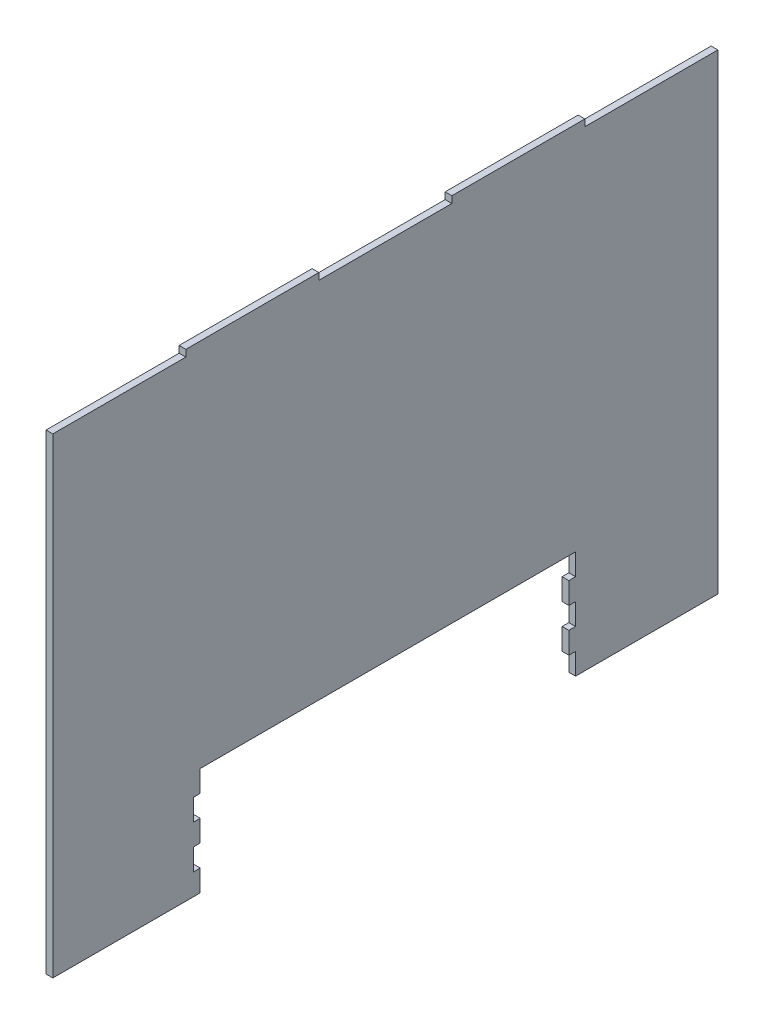
ISO-10303-21;
HEADER;
FILE_DESCRIPTION(('STEP AP214'),'2;1');
FILE_NAME('part.step','',(''),(''),'','','');
FILE_SCHEMA(('AUTOMOTIVE_DESIGN { 1 0 10303 214 1 1 1 1 }'));
ENDSEC;
DATA;
#1=APPLICATION_CONTEXT('core data for automotive mechanical design processes');
#2=APPLICATION_PROTOCOL_DEFINITION('international standard','automotive_design',2000,#1);
#3=PRODUCT_CONTEXT('',#1,'mechanical');
#4=PRODUCT('Part','Part','',(#3));
#5=PRODUCT_RELATED_PRODUCT_CATEGORY('part','',(#4));
#6=PRODUCT_DEFINITION_FORMATION('','',#4);
#7=PRODUCT_DEFINITION_CONTEXT('part definition',#1,'design');
#8=PRODUCT_DEFINITION('design','',#6,#7);
#9=PRODUCT_DEFINITION_SHAPE('','',#8);
#10=(LENGTH_UNIT() NAMED_UNIT(*) SI_UNIT(.MILLI.,.METRE.));
#11=(NAMED_UNIT(*) PLANE_ANGLE_UNIT() SI_UNIT($,.RADIAN.));
#12=(NAMED_UNIT(*) SI_UNIT($,.STERADIAN.) SOLID_ANGLE_UNIT());
#13=UNCERTAINTY_MEASURE_WITH_UNIT(LENGTH_MEASURE(1.E-05),#10,'distance_accuracy_value','');
#14=(GEOMETRIC_REPRESENTATION_CONTEXT(3) GLOBAL_UNCERTAINTY_ASSIGNED_CONTEXT((#13)) GLOBAL_UNIT_ASSIGNED_CONTEXT((#10,
#11,#12)) REPRESENTATION_CONTEXT('',''));
#15=CARTESIAN_POINT('',(0.,0.,0.));
#16=DIRECTION('',(0.,0.,1.));
#17=DIRECTION('',(1.,0.,0.));
#18=AXIS2_PLACEMENT_3D('',#15,#16,#17);
#19=CARTESIAN_POINT('',(5.,-72.5,-141.262721236259));
#20=DIRECTION('',(0.,1.,0.));
#21=DIRECTION('',(0.,0.,1.));
#22=AXIS2_PLACEMENT_3D('',#19,#20,#21);
#23=PLANE('',#22);
#24=DIRECTION('',(0.,0.,-1.));
#25=VECTOR('',#24,1.);
#26=CARTESIAN_POINT('',(0.,-72.5,-141.262721236259));
#27=LINE('',#26,#25);
#28=CARTESIAN_POINT('',(0.,-72.5,-141.262721236259));
#29=VERTEX_POINT('',#28);
#30=CARTESIAN_POINT('',(0.,-72.5,-247.));
#31=VERTEX_POINT('',#30);
#32=EDGE_CURVE('E273',#29,#31,#27,.T.);
#33=ORIENTED_EDGE('',*,*,#32,.T.);
#34=DIRECTION('',(-1.,0.,0.));
#35=VECTOR('',#34,1.);
#36=CARTESIAN_POINT('',(5.,-72.5,-247.));
#37=LINE('',#36,#35);
#38=CARTESIAN_POINT('',(5.,-72.5,-247.));
#39=VERTEX_POINT('',#38);
#40=EDGE_CURVE('E11',#39,#31,#37,.T.);
#41=ORIENTED_EDGE('',*,*,#40,.F.);
#42=DIRECTION('',(0.,0.,-1.));
#43=VECTOR('',#42,1.);
#44=CARTESIAN_POINT('',(5.,-72.5,-141.262721236259));
#45=LINE('',#44,#43);
#46=CARTESIAN_POINT('',(5.,-72.5,-141.262721236259));
#47=VERTEX_POINT('',#46);
#48=EDGE_CURVE('E336',#47,#39,#45,.T.);
#49=ORIENTED_EDGE('',*,*,#48,.F.);
#50=DIRECTION('',(-1.,0.,0.));
#51=VECTOR('',#50,1.);
#52=CARTESIAN_POINT('',(5.,-72.5,-141.262721236259));
#53=LINE('',#52,#51);
#54=EDGE_CURVE('E269',#47,#29,#53,.T.);
#55=ORIENTED_EDGE('',*,*,#54,.T.);
#56=EDGE_LOOP('',(#33,#41,#49,#55));
#57=FACE_BOUND('',#56,.T.);
#58=ADVANCED_FACE('F33',(#57),#23,.F.);
#59=CARTESIAN_POINT('',(5.,277.5,-247.));
#60=DIRECTION('',(0.,0.,1.));
#61=DIRECTION('',(0.,-1.,0.));
#62=AXIS2_PLACEMENT_3D('',#59,#60,#61);
#63=PLANE('',#62);
#64=DIRECTION('',(0.,1.,0.));
#65=VECTOR('',#64,1.);
#66=CARTESIAN_POINT('',(0.,277.5,-247.));
#67=LINE('',#66,#65);
#68=CARTESIAN_POINT('',(0.,277.5,-247.));
#69=VERTEX_POINT('',#68);
#70=EDGE_CURVE('E276',#31,#69,#67,.T.);
#71=ORIENTED_EDGE('',*,*,#70,.T.);
#72=DIRECTION('',(-1.,0.,0.));
#73=VECTOR('',#72,1.);
#74=CARTESIAN_POINT('',(5.,277.5,-247.));
#75=LINE('',#74,#73);
#76=CARTESIAN_POINT('',(5.,277.5,-247.));
#77=VERTEX_POINT('',#76);
#78=EDGE_CURVE('E41',#77,#69,#75,.T.);
#79=ORIENTED_EDGE('',*,*,#78,.F.);
#80=DIRECTION('',(0.,1.,0.));
#81=VECTOR('',#80,1.);
#82=CARTESIAN_POINT('',(5.,277.5,-247.));
#83=LINE('',#82,#81);
#84=EDGE_CURVE('E164',#39,#77,#83,.T.);
#85=ORIENTED_EDGE('',*,*,#84,.F.);
#86=ORIENTED_EDGE('',*,*,#40,.T.);
#87=EDGE_LOOP('',(#71,#79,#85,#86));
#88=FACE_BOUND('',#87,.T.);
#89=ADVANCED_FACE('F514',(#88),#63,.F.);
#90=CARTESIAN_POINT('',(5.,277.5,-148.2));
#91=DIRECTION('',(0.,-1.,0.));
#92=DIRECTION('',(0.,0.,-1.));
#93=AXIS2_PLACEMENT_3D('',#90,#91,#92);
#94=PLANE('',#93);
#95=DIRECTION('',(0.,0.,1.));
#96=VECTOR('',#95,1.);
#97=CARTESIAN_POINT('',(0.,277.5,-148.2));
#98=LINE('',#97,#96);
#99=CARTESIAN_POINT('',(0.,277.5,-148.2));
#100=VERTEX_POINT('',#99);
#101=EDGE_CURVE('E278',#69,#100,#98,.T.);
#102=ORIENTED_EDGE('',*,*,#101,.T.);
#103=DIRECTION('',(-1.,0.,0.));
#104=VECTOR('',#103,1.);
#105=CARTESIAN_POINT('',(5.,277.5,-148.2));
#106=LINE('',#105,#104);
#107=CARTESIAN_POINT('',(5.,277.5,-148.2));
#108=VERTEX_POINT('',#107);
#109=EDGE_CURVE('E415',#108,#100,#106,.T.);
#110=ORIENTED_EDGE('',*,*,#109,.F.);
#111=DIRECTION('',(0.,0.,1.));
#112=VECTOR('',#111,1.);
#113=CARTESIAN_POINT('',(5.,277.5,-148.2));
#114=LINE('',#113,#112);
#115=EDGE_CURVE('E423',#77,#108,#114,.T.);
#116=ORIENTED_EDGE('',*,*,#115,.F.);
#117=ORIENTED_EDGE('',*,*,#78,.T.);
#118=EDGE_LOOP('',(#102,#110,#116,#117));
#119=FACE_BOUND('',#118,.T.);
#120=ADVANCED_FACE('F421',(#119),#94,.F.);
#121=CARTESIAN_POINT('',(5.,282.5,-148.2));
#122=DIRECTION('',(0.,0.,1.));
#123=DIRECTION('',(1.,0.,0.));
#124=AXIS2_PLACEMENT_3D('',#121,#122,#123);
#125=PLANE('',#124);
#126=DIRECTION('',(0.,1.,0.));
#127=VECTOR('',#126,1.);
#128=CARTESIAN_POINT('',(0.,282.5,-148.2));
#129=LINE('',#128,#127);
#130=CARTESIAN_POINT('',(0.,282.5,-148.2));
#131=VERTEX_POINT('',#130);
#132=EDGE_CURVE('E280',#100,#131,#129,.T.);
#133=ORIENTED_EDGE('',*,*,#132,.T.);
#134=DIRECTION('',(-1.,0.,0.));
#135=VECTOR('',#134,1.);
#136=CARTESIAN_POINT('',(5.,282.5,-148.2));
#137=LINE('',#136,#135);
#138=CARTESIAN_POINT('',(5.,282.5,-148.2));
#139=VERTEX_POINT('',#138);
#140=EDGE_CURVE('E412',#139,#131,#137,.T.);
#141=ORIENTED_EDGE('',*,*,#140,.F.);
#142=DIRECTION('',(0.,1.,0.));
#143=VECTOR('',#142,1.);
#144=CARTESIAN_POINT('',(5.,282.5,-148.2));
#145=LINE('',#144,#143);
#146=EDGE_CURVE('E441',#108,#139,#145,.T.);
#147=ORIENTED_EDGE('',*,*,#146,.F.);
#148=ORIENTED_EDGE('',*,*,#109,.T.);
#149=EDGE_LOOP('',(#133,#141,#147,#148));
#150=FACE_BOUND('',#149,.T.);
#151=ADVANCED_FACE('F432',(#150),#125,.F.);
#152=CARTESIAN_POINT('',(5.,282.5,-49.4000000000001));
#153=DIRECTION('',(0.,-1.,0.));
#154=DIRECTION('',(0.,0.,-1.));
#155=AXIS2_PLACEMENT_3D('',#152,#153,#154);
#156=PLANE('',#155);
#157=DIRECTION('',(0.,0.,1.));
#158=VECTOR('',#157,1.);
#159=CARTESIAN_POINT('',(0.,282.5,-49.4000000000001));
#160=LINE('',#159,#158);
#161=CARTESIAN_POINT('',(0.,282.5,-49.4000000000001));
#162=VERTEX_POINT('',#161);
#163=EDGE_CURVE('E282',#131,#162,#160,.T.);
#164=ORIENTED_EDGE('',*,*,#163,.T.);
#165=DIRECTION('',(-1.,0.,0.));
#166=VECTOR('',#165,1.);
#167=CARTESIAN_POINT('',(5.,282.5,-49.4000000000001));
#168=LINE('',#167,#166);
#169=CARTESIAN_POINT('',(5.,282.5,-49.4000000000001));
#170=VERTEX_POINT('',#169);
#171=EDGE_CURVE('E409',#170,#162,#168,.T.);
#172=ORIENTED_EDGE('',*,*,#171,.F.);
#173=DIRECTION('',(0.,0.,1.));
#174=VECTOR('',#173,1.);
#175=CARTESIAN_POINT('',(5.,282.5,-49.4000000000001));
#176=LINE('',#175,#174);
#177=EDGE_CURVE('E438',#139,#170,#176,.T.);
#178=ORIENTED_EDGE('',*,*,#177,.F.);
#179=ORIENTED_EDGE('',*,*,#140,.T.);
#180=EDGE_LOOP('',(#164,#172,#178,#179));
#181=FACE_BOUND('',#180,.T.);
#182=ADVANCED_FACE('F436',(#181),#156,.F.);
#183=CARTESIAN_POINT('',(5.,282.5,-49.4000000000001));
#184=DIRECTION('',(0.,0.,-1.));
#185=DIRECTION('',(-1.,0.,0.));
#186=AXIS2_PLACEMENT_3D('',#183,#184,#185);
#187=PLANE('',#186);
#188=DIRECTION('',(0.,-1.,0.));
#189=VECTOR('',#188,1.);
#190=CARTESIAN_POINT('',(0.,282.5,-49.4000000000001));
#191=LINE('',#190,#189);
#192=CARTESIAN_POINT('',(0.,277.5,-49.4000000000001));
#193=VERTEX_POINT('',#192);
#194=EDGE_CURVE('E284',#162,#193,#191,.T.);
#195=ORIENTED_EDGE('',*,*,#194,.T.);
#196=DIRECTION('',(-1.,0.,0.));
#197=VECTOR('',#196,1.);
#198=CARTESIAN_POINT('',(5.,277.5,-49.4000000000001));
#199=LINE('',#198,#197);
#200=CARTESIAN_POINT('',(5.,277.5,-49.4000000000001));
#201=VERTEX_POINT('',#200);
#202=EDGE_CURVE('E406',#201,#193,#199,.T.);
#203=ORIENTED_EDGE('',*,*,#202,.F.);
#204=DIRECTION('',(0.,-1.,0.));
#205=VECTOR('',#204,1.);
#206=CARTESIAN_POINT('',(5.,282.5,-49.4000000000001));
#207=LINE('',#206,#205);
#208=EDGE_CURVE('E440',#170,#201,#207,.T.);
#209=ORIENTED_EDGE('',*,*,#208,.F.);
#210=ORIENTED_EDGE('',*,*,#171,.T.);
#211=EDGE_LOOP('',(#195,#203,#209,#210));
#212=FACE_BOUND('',#211,.T.);
#213=ADVANCED_FACE('F527',(#212),#187,.F.);
#214=CARTESIAN_POINT('',(5.,277.5,49.3999999999999));
#215=DIRECTION('',(0.,-1.,0.));
#216=DIRECTION('',(0.,0.,-1.));
#217=AXIS2_PLACEMENT_3D('',#214,#215,#216);
#218=PLANE('',#217);
#219=DIRECTION('',(0.,0.,1.));
#220=VECTOR('',#219,1.);
#221=CARTESIAN_POINT('',(0.,277.5,49.3999999999999));
#222=LINE('',#221,#220);
#223=CARTESIAN_POINT('',(0.,277.5,49.3999999999999));
#224=VERTEX_POINT('',#223);
#225=EDGE_CURVE('E286',#193,#224,#222,.T.);
#226=ORIENTED_EDGE('',*,*,#225,.T.);
#227=DIRECTION('',(-1.,0.,0.));
#228=VECTOR('',#227,1.);
#229=CARTESIAN_POINT('',(5.,277.5,49.3999999999999));
#230=LINE('',#229,#228);
#231=CARTESIAN_POINT('',(5.,277.5,49.3999999999999));
#232=VERTEX_POINT('',#231);
#233=EDGE_CURVE('E403',#232,#224,#230,.T.);
#234=ORIENTED_EDGE('',*,*,#233,.F.);
#235=DIRECTION('',(0.,0.,1.));
#236=VECTOR('',#235,1.);
#237=CARTESIAN_POINT('',(5.,277.5,49.3999999999999));
#238=LINE('',#237,#236);
#239=EDGE_CURVE('E443',#201,#232,#238,.T.);
#240=ORIENTED_EDGE('',*,*,#239,.F.);
#241=ORIENTED_EDGE('',*,*,#202,.T.);
#242=EDGE_LOOP('',(#226,#234,#240,#241));
#243=FACE_BOUND('',#242,.T.);
#244=ADVANCED_FACE('F530',(#243),#218,.F.);
#245=CARTESIAN_POINT('',(5.,282.5,49.3999999999999));
#246=DIRECTION('',(0.,0.,1.));
#247=DIRECTION('',(1.,0.,0.));
#248=AXIS2_PLACEMENT_3D('',#245,#246,#247);
#249=PLANE('',#248);
#250=DIRECTION('',(0.,1.,0.));
#251=VECTOR('',#250,1.);
#252=CARTESIAN_POINT('',(0.,282.5,49.3999999999999));
#253=LINE('',#252,#251);
#254=CARTESIAN_POINT('',(0.,282.5,49.3999999999999));
#255=VERTEX_POINT('',#254);
#256=EDGE_CURVE('E288',#224,#255,#253,.T.);
#257=ORIENTED_EDGE('',*,*,#256,.T.);
#258=DIRECTION('',(-1.,0.,0.));
#259=VECTOR('',#258,1.);
#260=CARTESIAN_POINT('',(5.,282.5,49.3999999999999));
#261=LINE('',#260,#259);
#262=CARTESIAN_POINT('',(5.,282.5,49.3999999999999));
#263=VERTEX_POINT('',#262);
#264=EDGE_CURVE('E400',#263,#255,#261,.T.);
#265=ORIENTED_EDGE('',*,*,#264,.F.);
#266=DIRECTION('',(0.,1.,0.));
#267=VECTOR('',#266,1.);
#268=CARTESIAN_POINT('',(5.,282.5,49.3999999999999));
#269=LINE('',#268,#267);
#270=EDGE_CURVE('E449',#232,#263,#269,.T.);
#271=ORIENTED_EDGE('',*,*,#270,.F.);
#272=ORIENTED_EDGE('',*,*,#233,.T.);
#273=EDGE_LOOP('',(#257,#265,#271,#272));
#274=FACE_BOUND('',#273,.T.);
#275=ADVANCED_FACE('F534',(#274),#249,.F.);
#276=CARTESIAN_POINT('',(5.,282.5,148.2));
#277=DIRECTION('',(0.,-1.,0.));
#278=DIRECTION('',(0.,0.,-1.));
#279=AXIS2_PLACEMENT_3D('',#276,#277,#278);
#280=PLANE('',#279);
#281=DIRECTION('',(0.,0.,1.));
#282=VECTOR('',#281,1.);
#283=CARTESIAN_POINT('',(0.,282.5,148.2));
#284=LINE('',#283,#282);
#285=CARTESIAN_POINT('',(0.,282.5,148.2));
#286=VERTEX_POINT('',#285);
#287=EDGE_CURVE('E290',#255,#286,#284,.T.);
#288=ORIENTED_EDGE('',*,*,#287,.T.);
#289=DIRECTION('',(-1.,0.,0.));
#290=VECTOR('',#289,1.);
#291=CARTESIAN_POINT('',(5.,282.5,148.2));
#292=LINE('',#291,#290);
#293=CARTESIAN_POINT('',(5.,282.5,148.2));
#294=VERTEX_POINT('',#293);
#295=EDGE_CURVE('E397',#294,#286,#292,.T.);
#296=ORIENTED_EDGE('',*,*,#295,.F.);
#297=DIRECTION('',(0.,0.,1.));
#298=VECTOR('',#297,1.);
#299=CARTESIAN_POINT('',(5.,282.5,148.2));
#300=LINE('',#299,#298);
#301=EDGE_CURVE('E451',#263,#294,#300,.T.);
#302=ORIENTED_EDGE('',*,*,#301,.F.);
#303=ORIENTED_EDGE('',*,*,#264,.T.);
#304=EDGE_LOOP('',(#288,#296,#302,#303));
#305=FACE_BOUND('',#304,.T.);
#306=ADVANCED_FACE('F538',(#305),#280,.F.);
#307=CARTESIAN_POINT('',(5.,282.5,148.2));
#308=DIRECTION('',(0.,0.,-1.));
#309=DIRECTION('',(-1.,0.,0.));
#310=AXIS2_PLACEMENT_3D('',#307,#308,#309);
#311=PLANE('',#310);
#312=DIRECTION('',(0.,-1.,0.));
#313=VECTOR('',#312,1.);
#314=CARTESIAN_POINT('',(0.,282.5,148.2));
#315=LINE('',#314,#313);
#316=CARTESIAN_POINT('',(0.,277.5,148.2));
#317=VERTEX_POINT('',#316);
#318=EDGE_CURVE('E292',#286,#317,#315,.T.);
#319=ORIENTED_EDGE('',*,*,#318,.T.);
#320=DIRECTION('',(-1.,0.,0.));
#321=VECTOR('',#320,1.);
#322=CARTESIAN_POINT('',(5.,277.5,148.2));
#323=LINE('',#322,#321);
#324=CARTESIAN_POINT('',(5.,277.5,148.2));
#325=VERTEX_POINT('',#324);
#326=EDGE_CURVE('E394',#325,#317,#323,.T.);
#327=ORIENTED_EDGE('',*,*,#326,.F.);
#328=DIRECTION('',(0.,-1.,0.));
#329=VECTOR('',#328,1.);
#330=CARTESIAN_POINT('',(5.,282.5,148.2));
#331=LINE('',#330,#329);
#332=EDGE_CURVE('E453',#294,#325,#331,.T.);
#333=ORIENTED_EDGE('',*,*,#332,.F.);
#334=ORIENTED_EDGE('',*,*,#295,.T.);
#335=EDGE_LOOP('',(#319,#327,#333,#334));
#336=FACE_BOUND('',#335,.T.);
#337=ADVANCED_FACE('F542',(#336),#311,.F.);
#338=CARTESIAN_POINT('',(5.,277.5,247.));
#339=DIRECTION('',(0.,-1.,0.));
#340=DIRECTION('',(0.,0.,-1.));
#341=AXIS2_PLACEMENT_3D('',#338,#339,#340);
#342=PLANE('',#341);
#343=DIRECTION('',(0.,0.,1.));
#344=VECTOR('',#343,1.);
#345=CARTESIAN_POINT('',(0.,277.5,247.));
#346=LINE('',#345,#344);
#347=CARTESIAN_POINT('',(0.,277.5,247.));
#348=VERTEX_POINT('',#347);
#349=EDGE_CURVE('E294',#317,#348,#346,.T.);
#350=ORIENTED_EDGE('',*,*,#349,.T.);
#351=DIRECTION('',(-1.,0.,0.));
#352=VECTOR('',#351,1.);
#353=CARTESIAN_POINT('',(5.,277.5,247.));
#354=LINE('',#353,#352);
#355=CARTESIAN_POINT('',(5.,277.5,247.));
#356=VERTEX_POINT('',#355);
#357=EDGE_CURVE('E391',#356,#348,#354,.T.);
#358=ORIENTED_EDGE('',*,*,#357,.F.);
#359=DIRECTION('',(0.,0.,1.));
#360=VECTOR('',#359,1.);
#361=CARTESIAN_POINT('',(5.,277.5,247.));
#362=LINE('',#361,#360);
#363=EDGE_CURVE('E455',#325,#356,#362,.T.);
#364=ORIENTED_EDGE('',*,*,#363,.F.);
#365=ORIENTED_EDGE('',*,*,#326,.T.);
#366=EDGE_LOOP('',(#350,#358,#364,#365));
#367=FACE_BOUND('',#366,.T.);
#368=ADVANCED_FACE('F546',(#367),#342,.F.);
#369=CARTESIAN_POINT('',(5.,277.5,247.));
#370=DIRECTION('',(0.,0.,-1.));
#371=DIRECTION('',(0.,1.,0.));
#372=AXIS2_PLACEMENT_3D('',#369,#370,#371);
#373=PLANE('',#372);
#374=DIRECTION('',(0.,-1.,0.));
#375=VECTOR('',#374,1.);
#376=CARTESIAN_POINT('',(0.,277.5,247.));
#377=LINE('',#376,#375);
#378=CARTESIAN_POINT('',(0.,-72.5,247.));
#379=VERTEX_POINT('',#378);
#380=EDGE_CURVE('E296',#348,#379,#377,.T.);
#381=ORIENTED_EDGE('',*,*,#380,.T.);
#382=DIRECTION('',(-1.,0.,0.));
#383=VECTOR('',#382,1.);
#384=CARTESIAN_POINT('',(5.,-72.5,247.));
#385=LINE('',#384,#383);
#386=CARTESIAN_POINT('',(5.,-72.5,247.));
#387=VERTEX_POINT('',#386);
#388=EDGE_CURVE('E388',#387,#379,#385,.T.);
#389=ORIENTED_EDGE('',*,*,#388,.F.);
#390=DIRECTION('',(0.,-1.,0.));
#391=VECTOR('',#390,1.);
#392=CARTESIAN_POINT('',(5.,277.5,247.));
#393=LINE('',#392,#391);
#394=EDGE_CURVE('E457',#356,#387,#393,.T.);
#395=ORIENTED_EDGE('',*,*,#394,.F.);
#396=ORIENTED_EDGE('',*,*,#357,.T.);
#397=EDGE_LOOP('',(#381,#389,#395,#396));
#398=FACE_BOUND('',#397,.T.);
#399=ADVANCED_FACE('F550',(#398),#373,.F.);
#400=CARTESIAN_POINT('',(5.,-72.5,247.));
#401=DIRECTION('',(0.,1.,0.));
#402=DIRECTION('',(0.,0.,1.));
#403=AXIS2_PLACEMENT_3D('',#400,#401,#402);
#404=PLANE('',#403);
#405=DIRECTION('',(0.,0.,-1.));
#406=VECTOR('',#405,1.);
#407=CARTESIAN_POINT('',(0.,-72.5,247.));
#408=LINE('',#407,#406);
#409=CARTESIAN_POINT('',(0.,-72.5,137.5));
#410=VERTEX_POINT('',#409);
#411=EDGE_CURVE('E298',#379,#410,#408,.T.);
#412=ORIENTED_EDGE('',*,*,#411,.T.);
#413=DIRECTION('',(-1.,0.,0.));
#414=VECTOR('',#413,1.);
#415=CARTESIAN_POINT('',(5.,-72.5,137.5));
#416=LINE('',#415,#414);
#417=CARTESIAN_POINT('',(5.,-72.5,137.5));
#418=VERTEX_POINT('',#417);
#419=EDGE_CURVE('E385',#418,#410,#416,.T.);
#420=ORIENTED_EDGE('',*,*,#419,.F.);
#421=DIRECTION('',(0.,0.,-1.));
#422=VECTOR('',#421,1.);
#423=CARTESIAN_POINT('',(5.,-72.5,247.));
#424=LINE('',#423,#422);
#425=EDGE_CURVE('E459',#387,#418,#424,.T.);
#426=ORIENTED_EDGE('',*,*,#425,.F.);
#427=ORIENTED_EDGE('',*,*,#388,.T.);
#428=EDGE_LOOP('',(#412,#420,#426,#427));
#429=FACE_BOUND('',#428,.T.);
#430=ADVANCED_FACE('F554',(#429),#404,.F.);
#431=CARTESIAN_POINT('',(5.,-72.5,137.5));
#432=DIRECTION('',(0.,0.,1.));
#433=DIRECTION('',(1.,0.,0.));
#434=AXIS2_PLACEMENT_3D('',#431,#432,#433);
#435=PLANE('',#434);
#436=DIRECTION('',(0.,1.,0.));
#437=VECTOR('',#436,1.);
#438=CARTESIAN_POINT('',(0.,-72.5,137.5));
#439=LINE('',#438,#437);
#440=CARTESIAN_POINT('',(0.,-56.5,137.5));
#441=VERTEX_POINT('',#440);
#442=EDGE_CURVE('E300',#410,#441,#439,.T.);
#443=ORIENTED_EDGE('',*,*,#442,.T.);
#444=DIRECTION('',(-1.,0.,0.));
#445=VECTOR('',#444,1.);
#446=CARTESIAN_POINT('',(5.,-56.5,137.5));
#447=LINE('',#446,#445);
#448=CARTESIAN_POINT('',(5.,-56.5,137.5));
#449=VERTEX_POINT('',#448);
#450=EDGE_CURVE('E382',#449,#441,#447,.T.);
#451=ORIENTED_EDGE('',*,*,#450,.F.);
#452=DIRECTION('',(0.,1.,0.));
#453=VECTOR('',#452,1.);
#454=CARTESIAN_POINT('',(5.,-72.5,137.5));
#455=LINE('',#454,#453);
#456=EDGE_CURVE('E461',#418,#449,#455,.T.);
#457=ORIENTED_EDGE('',*,*,#456,.F.);
#458=ORIENTED_EDGE('',*,*,#419,.T.);
#459=EDGE_LOOP('',(#443,#451,#457,#458));
#460=FACE_BOUND('',#459,.T.);
#461=ADVANCED_FACE('F558',(#460),#435,.F.);
#462=CARTESIAN_POINT('',(5.,-56.5,142.5));
#463=DIRECTION('',(0.,-1.,0.));
#464=DIRECTION('',(0.,0.,-1.));
#465=AXIS2_PLACEMENT_3D('',#462,#463,#464);
#466=PLANE('',#465);
#467=DIRECTION('',(0.,0.,1.));
#468=VECTOR('',#467,1.);
#469=CARTESIAN_POINT('',(0.,-56.5,142.5));
#470=LINE('',#469,#468);
#471=CARTESIAN_POINT('',(0.,-56.5,142.5));
#472=VERTEX_POINT('',#471);
#473=EDGE_CURVE('E302',#441,#472,#470,.T.);
#474=ORIENTED_EDGE('',*,*,#473,.T.);
#475=DIRECTION('',(-1.,0.,0.));
#476=VECTOR('',#475,1.);
#477=CARTESIAN_POINT('',(5.,-56.5,142.5));
#478=LINE('',#477,#476);
#479=CARTESIAN_POINT('',(5.,-56.5,142.5));
#480=VERTEX_POINT('',#479);
#481=EDGE_CURVE('E379',#480,#472,#478,.T.);
#482=ORIENTED_EDGE('',*,*,#481,.F.);
#483=DIRECTION('',(0.,0.,1.));
#484=VECTOR('',#483,1.);
#485=CARTESIAN_POINT('',(5.,-56.5,142.5));
#486=LINE('',#485,#484);
#487=EDGE_CURVE('E463',#449,#480,#486,.T.);
#488=ORIENTED_EDGE('',*,*,#487,.F.);
#489=ORIENTED_EDGE('',*,*,#450,.T.);
#490=EDGE_LOOP('',(#474,#482,#488,#489));
#491=FACE_BOUND('',#490,.T.);
#492=ADVANCED_FACE('F562',(#491),#466,.F.);
#493=CARTESIAN_POINT('',(5.,-40.5,142.5));
#494=DIRECTION('',(0.,0.,1.));
#495=DIRECTION('',(1.,0.,0.));
#496=AXIS2_PLACEMENT_3D('',#493,#494,#495);
#497=PLANE('',#496);
#498=DIRECTION('',(0.,1.,0.));
#499=VECTOR('',#498,1.);
#500=CARTESIAN_POINT('',(0.,-40.5,142.5));
#501=LINE('',#500,#499);
#502=CARTESIAN_POINT('',(0.,-40.5,142.5));
#503=VERTEX_POINT('',#502);
#504=EDGE_CURVE('E304',#472,#503,#501,.T.);
#505=ORIENTED_EDGE('',*,*,#504,.T.);
#506=DIRECTION('',(-1.,0.,0.));
#507=VECTOR('',#506,1.);
#508=CARTESIAN_POINT('',(5.,-40.5,142.5));
#509=LINE('',#508,#507);
#510=CARTESIAN_POINT('',(5.,-40.5,142.5));
#511=VERTEX_POINT('',#510);
#512=EDGE_CURVE('E376',#511,#503,#509,.T.);
#513=ORIENTED_EDGE('',*,*,#512,.F.);
#514=DIRECTION('',(0.,1.,0.));
#515=VECTOR('',#514,1.);
#516=CARTESIAN_POINT('',(5.,-40.5,142.5));
#517=LINE('',#516,#515);
#518=EDGE_CURVE('E465',#480,#511,#517,.T.);
#519=ORIENTED_EDGE('',*,*,#518,.F.);
#520=ORIENTED_EDGE('',*,*,#481,.T.);
#521=EDGE_LOOP('',(#505,#513,#519,#520));
#522=FACE_BOUND('',#521,.T.);
#523=ADVANCED_FACE('F566',(#522),#497,.F.);
#524=CARTESIAN_POINT('',(5.,-40.5,142.5));
#525=DIRECTION('',(0.,0.999604371182129,0.0281265197559325));
#526=DIRECTION('',(0.,-0.0281265197559325,0.999604371182129));
#527=AXIS2_PLACEMENT_3D('',#524,#525,#526);
#528=PLANE('',#527);
#529=DIRECTION('',(0.,0.0281265197559325,-0.999604371182129));
#530=VECTOR('',#529,1.);
#531=CARTESIAN_POINT('',(0.,-40.5,142.5));
#532=LINE('',#531,#530);
#533=CARTESIAN_POINT('',(0.,-40.3593117408907,137.5));
#534=VERTEX_POINT('',#533);
#535=EDGE_CURVE('E306',#503,#534,#532,.T.);
#536=ORIENTED_EDGE('',*,*,#535,.T.);
#537=DIRECTION('',(-1.,0.,0.));
#538=VECTOR('',#537,1.);
#539=CARTESIAN_POINT('',(5.,-40.3593117408907,137.5));
#540=LINE('',#539,#538);
#541=CARTESIAN_POINT('',(5.,-40.3593117408907,137.5));
#542=VERTEX_POINT('',#541);
#543=EDGE_CURVE('E373',#542,#534,#540,.T.);
#544=ORIENTED_EDGE('',*,*,#543,.F.);
#545=DIRECTION('',(0.,0.0281265197559325,-0.999604371182129));
#546=VECTOR('',#545,1.);
#547=CARTESIAN_POINT('',(5.,-40.5,142.5));
#548=LINE('',#547,#546);
#549=EDGE_CURVE('E467',#511,#542,#548,.T.);
#550=ORIENTED_EDGE('',*,*,#549,.F.);
#551=ORIENTED_EDGE('',*,*,#512,.T.);
#552=EDGE_LOOP('',(#536,#544,#550,#551));
#553=FACE_BOUND('',#552,.T.);
#554=ADVANCED_FACE('F570',(#553),#528,.F.);
#555=CARTESIAN_POINT('',(5.,-40.3593117408907,137.5));
#556=DIRECTION('',(0.,0.,1.));
#557=DIRECTION('',(0.,-1.,0.));
#558=AXIS2_PLACEMENT_3D('',#555,#556,#557);
#559=PLANE('',#558);
#560=DIRECTION('',(0.,1.,0.));
#561=VECTOR('',#560,1.);
#562=CARTESIAN_POINT('',(0.,-40.3593117408907,137.5));
#563=LINE('',#562,#561);
#564=CARTESIAN_POINT('',(0.,-24.5,137.5));
#565=VERTEX_POINT('',#564);
#566=EDGE_CURVE('E308',#534,#565,#563,.T.);
#567=ORIENTED_EDGE('',*,*,#566,.T.);
#568=DIRECTION('',(-1.,0.,0.));
#569=VECTOR('',#568,1.);
#570=CARTESIAN_POINT('',(5.,-24.5,137.5));
#571=LINE('',#570,#569);
#572=CARTESIAN_POINT('',(5.,-24.5,137.5));
#573=VERTEX_POINT('',#572);
#574=EDGE_CURVE('E370',#573,#565,#571,.T.);
#575=ORIENTED_EDGE('',*,*,#574,.F.);
#576=DIRECTION('',(0.,1.,0.));
#577=VECTOR('',#576,1.);
#578=CARTESIAN_POINT('',(5.,-40.3593117408907,137.5));
#579=LINE('',#578,#577);
#580=EDGE_CURVE('E469',#542,#573,#579,.T.);
#581=ORIENTED_EDGE('',*,*,#580,.F.);
#582=ORIENTED_EDGE('',*,*,#543,.T.);
#583=EDGE_LOOP('',(#567,#575,#581,#582));
#584=FACE_BOUND('',#583,.T.);
#585=ADVANCED_FACE('F574',(#584),#559,.F.);
#586=CARTESIAN_POINT('',(5.,-24.5,142.5));
#587=DIRECTION('',(0.,-1.,0.));
#588=DIRECTION('',(0.,0.,-1.));
#589=AXIS2_PLACEMENT_3D('',#586,#587,#588);
#590=PLANE('',#589);
#591=DIRECTION('',(0.,0.,1.));
#592=VECTOR('',#591,1.);
#593=CARTESIAN_POINT('',(0.,-24.5,142.5));
#594=LINE('',#593,#592);
#595=CARTESIAN_POINT('',(0.,-24.5,142.5));
#596=VERTEX_POINT('',#595);
#597=EDGE_CURVE('E310',#565,#596,#594,.T.);
#598=ORIENTED_EDGE('',*,*,#597,.T.);
#599=DIRECTION('',(-1.,0.,0.));
#600=VECTOR('',#599,1.);
#601=CARTESIAN_POINT('',(5.,-24.5,142.5));
#602=LINE('',#601,#600);
#603=CARTESIAN_POINT('',(5.,-24.5,142.5));
#604=VERTEX_POINT('',#603);
#605=EDGE_CURVE('E367',#604,#596,#602,.T.);
#606=ORIENTED_EDGE('',*,*,#605,.F.);
#607=DIRECTION('',(0.,0.,1.));
#608=VECTOR('',#607,1.);
#609=CARTESIAN_POINT('',(5.,-24.5,142.5));
#610=LINE('',#609,#608);
#611=EDGE_CURVE('E471',#573,#604,#610,.T.);
#612=ORIENTED_EDGE('',*,*,#611,.F.);
#613=ORIENTED_EDGE('',*,*,#574,.T.);
#614=EDGE_LOOP('',(#598,#606,#612,#613));
#615=FACE_BOUND('',#614,.T.);
#616=ADVANCED_FACE('F578',(#615),#590,.F.);
#617=CARTESIAN_POINT('',(5.,-8.50000000000001,142.5));
#618=DIRECTION('',(0.,0.,1.));
#619=DIRECTION('',(1.,0.,0.));
#620=AXIS2_PLACEMENT_3D('',#617,#618,#619);
#621=PLANE('',#620);
#622=DIRECTION('',(0.,1.,0.));
#623=VECTOR('',#622,1.);
#624=CARTESIAN_POINT('',(0.,-8.50000000000001,142.5));
#625=LINE('',#624,#623);
#626=CARTESIAN_POINT('',(0.,-8.50000000000001,142.5));
#627=VERTEX_POINT('',#626);
#628=EDGE_CURVE('E312',#596,#627,#625,.T.);
#629=ORIENTED_EDGE('',*,*,#628,.T.);
#630=DIRECTION('',(-1.,0.,0.));
#631=VECTOR('',#630,1.);
#632=CARTESIAN_POINT('',(5.,-8.50000000000001,142.5));
#633=LINE('',#632,#631);
#634=CARTESIAN_POINT('',(5.,-8.50000000000001,142.5));
#635=VERTEX_POINT('',#634);
#636=EDGE_CURVE('E364',#635,#627,#633,.T.);
#637=ORIENTED_EDGE('',*,*,#636,.F.);
#638=DIRECTION('',(0.,1.,0.));
#639=VECTOR('',#638,1.);
#640=CARTESIAN_POINT('',(5.,-8.50000000000001,142.5));
#641=LINE('',#640,#639);
#642=EDGE_CURVE('E473',#604,#635,#641,.T.);
#643=ORIENTED_EDGE('',*,*,#642,.F.);
#644=ORIENTED_EDGE('',*,*,#605,.T.);
#645=EDGE_LOOP('',(#629,#637,#643,#644));
#646=FACE_BOUND('',#645,.T.);
#647=ADVANCED_FACE('F582',(#646),#621,.F.);
#648=CARTESIAN_POINT('',(5.,-8.50000000000001,142.5));
#649=DIRECTION('',(0.,1.,0.));
#650=DIRECTION('',(0.,0.,1.));
#651=AXIS2_PLACEMENT_3D('',#648,#649,#650);
#652=PLANE('',#651);
#653=DIRECTION('',(0.,0.,-1.));
#654=VECTOR('',#653,1.);
#655=CARTESIAN_POINT('',(0.,-8.50000000000001,142.5));
#656=LINE('',#655,#654);
#657=CARTESIAN_POINT('',(0.,-8.50000000000001,137.5));
#658=VERTEX_POINT('',#657);
#659=EDGE_CURVE('E314',#627,#658,#656,.T.);
#660=ORIENTED_EDGE('',*,*,#659,.T.);
#661=DIRECTION('',(-1.,0.,0.));
#662=VECTOR('',#661,1.);
#663=CARTESIAN_POINT('',(5.,-8.50000000000001,137.5));
#664=LINE('',#663,#662);
#665=CARTESIAN_POINT('',(5.,-8.50000000000001,137.5));
#666=VERTEX_POINT('',#665);
#667=EDGE_CURVE('E361',#666,#658,#664,.T.);
#668=ORIENTED_EDGE('',*,*,#667,.F.);
#669=DIRECTION('',(0.,0.,-1.));
#670=VECTOR('',#669,1.);
#671=CARTESIAN_POINT('',(5.,-8.50000000000001,142.5));
#672=LINE('',#671,#670);
#673=EDGE_CURVE('E475',#635,#666,#672,.T.);
#674=ORIENTED_EDGE('',*,*,#673,.F.);
#675=ORIENTED_EDGE('',*,*,#636,.T.);
#676=EDGE_LOOP('',(#660,#668,#674,#675));
#677=FACE_BOUND('',#676,.T.);
#678=ADVANCED_FACE('F586',(#677),#652,.F.);
#679=CARTESIAN_POINT('',(5.,-8.50000000000001,137.5));
#680=DIRECTION('',(0.,0.,1.));
#681=DIRECTION('',(1.,0.,0.));
#682=AXIS2_PLACEMENT_3D('',#679,#680,#681);
#683=PLANE('',#682);
#684=DIRECTION('',(0.,1.,0.));
#685=VECTOR('',#684,1.);
#686=CARTESIAN_POINT('',(0.,-8.50000000000001,137.5));
#687=LINE('',#686,#685);
#688=CARTESIAN_POINT('',(0.,7.49999999999999,137.5));
#689=VERTEX_POINT('',#688);
#690=EDGE_CURVE('E316',#658,#689,#687,.T.);
#691=ORIENTED_EDGE('',*,*,#690,.T.);
#692=DIRECTION('',(-1.,0.,0.));
#693=VECTOR('',#692,1.);
#694=CARTESIAN_POINT('',(5.,7.49999999999999,137.5));
#695=LINE('',#694,#693);
#696=CARTESIAN_POINT('',(5.,7.49999999999999,137.5));
#697=VERTEX_POINT('',#696);
#698=EDGE_CURVE('E358',#697,#689,#695,.T.);
#699=ORIENTED_EDGE('',*,*,#698,.F.);
#700=DIRECTION('',(0.,1.,0.));
#701=VECTOR('',#700,1.);
#702=CARTESIAN_POINT('',(5.,-8.50000000000001,137.5));
#703=LINE('',#702,#701);
#704=EDGE_CURVE('E477',#666,#697,#703,.T.);
#705=ORIENTED_EDGE('',*,*,#704,.F.);
#706=ORIENTED_EDGE('',*,*,#667,.T.);
#707=EDGE_LOOP('',(#691,#699,#705,#706));
#708=FACE_BOUND('',#707,.T.);
#709=ADVANCED_FACE('F590',(#708),#683,.F.);
#710=CARTESIAN_POINT('',(5.,7.50000000000001,0.));
#711=DIRECTION('',(0.,1.,0.));
#712=DIRECTION('',(0.,0.,1.));
#713=AXIS2_PLACEMENT_3D('',#710,#711,#712);
#714=PLANE('',#713);
#715=DIRECTION('',(0.,0.,-1.));
#716=VECTOR('',#715,1.);
#717=CARTESIAN_POINT('',(0.,7.50000000000001,0.));
#718=LINE('',#717,#716);
#719=CARTESIAN_POINT('',(0.,7.50000000000001,-141.262721236259));
#720=VERTEX_POINT('',#719);
#721=EDGE_CURVE('E319',#689,#720,#718,.T.);
#722=ORIENTED_EDGE('',*,*,#721,.T.);
#723=DIRECTION('',(-1.,0.,0.));
#724=VECTOR('',#723,1.);
#725=CARTESIAN_POINT('',(5.,7.50000000000001,-141.262721236259));
#726=LINE('',#725,#724);
#727=CARTESIAN_POINT('',(5.,7.50000000000001,-141.262721236259));
#728=VERTEX_POINT('',#727);
#729=EDGE_CURVE('E355',#728,#720,#726,.T.);
#730=ORIENTED_EDGE('',*,*,#729,.F.);
#731=DIRECTION('',(0.,0.,-1.));
#732=VECTOR('',#731,1.);
#733=CARTESIAN_POINT('',(5.,7.50000000000001,0.));
#734=LINE('',#733,#732);
#735=EDGE_CURVE('E479',#697,#728,#734,.T.);
#736=ORIENTED_EDGE('',*,*,#735,.F.);
#737=ORIENTED_EDGE('',*,*,#698,.T.);
#738=EDGE_LOOP('',(#722,#730,#736,#737));
#739=FACE_BOUND('',#738,.T.);
#740=ADVANCED_FACE('F594',(#739),#714,.F.);
#741=CARTESIAN_POINT('',(5.,7.50000000000001,-141.262721236259));
#742=DIRECTION('',(0.,0.,-1.));
#743=DIRECTION('',(-1.,0.,0.));
#744=AXIS2_PLACEMENT_3D('',#741,#742,#743);
#745=PLANE('',#744);
#746=DIRECTION('',(0.,-1.,0.));
#747=VECTOR('',#746,1.);
#748=CARTESIAN_POINT('',(0.,7.50000000000001,-141.262721236259));
#749=LINE('',#748,#747);
#750=CARTESIAN_POINT('',(0.,-8.49999999999999,-141.262721236259));
#751=VERTEX_POINT('',#750);
#752=EDGE_CURVE('E321',#720,#751,#749,.T.);
#753=ORIENTED_EDGE('',*,*,#752,.T.);
#754=DIRECTION('',(-1.,0.,0.));
#755=VECTOR('',#754,1.);
#756=CARTESIAN_POINT('',(5.,-8.49999999999999,-141.262721236259));
#757=LINE('',#756,#755);
#758=CARTESIAN_POINT('',(5.,-8.49999999999999,-141.262721236259));
#759=VERTEX_POINT('',#758);
#760=EDGE_CURVE('E352',#759,#751,#757,.T.);
#761=ORIENTED_EDGE('',*,*,#760,.F.);
#762=DIRECTION('',(0.,-1.,0.));
#763=VECTOR('',#762,1.);
#764=CARTESIAN_POINT('',(5.,7.50000000000001,-141.262721236259));
#765=LINE('',#764,#763);
#766=EDGE_CURVE('E481',#728,#759,#765,.T.);
#767=ORIENTED_EDGE('',*,*,#766,.F.);
#768=ORIENTED_EDGE('',*,*,#729,.T.);
#769=EDGE_LOOP('',(#753,#761,#767,#768));
#770=FACE_BOUND('',#769,.T.);
#771=ADVANCED_FACE('F598',(#770),#745,.F.);
#772=CARTESIAN_POINT('',(5.,-8.49999999999999,-136.262721236259));
#773=DIRECTION('',(0.,-1.,0.));
#774=DIRECTION('',(0.,0.,-1.));
#775=AXIS2_PLACEMENT_3D('',#772,#773,#774);
#776=PLANE('',#775);
#777=DIRECTION('',(0.,0.,1.));
#778=VECTOR('',#777,1.);
#779=CARTESIAN_POINT('',(0.,-8.49999999999999,-136.262721236259));
#780=LINE('',#779,#778);
#781=CARTESIAN_POINT('',(0.,-8.49999999999999,-136.262721236259));
#782=VERTEX_POINT('',#781);
#783=EDGE_CURVE('E323',#751,#782,#780,.T.);
#784=ORIENTED_EDGE('',*,*,#783,.T.);
#785=DIRECTION('',(-1.,0.,0.));
#786=VECTOR('',#785,1.);
#787=CARTESIAN_POINT('',(5.,-8.49999999999999,-136.262721236259));
#788=LINE('',#787,#786);
#789=CARTESIAN_POINT('',(5.,-8.49999999999999,-136.262721236259));
#790=VERTEX_POINT('',#789);
#791=EDGE_CURVE('E349',#790,#782,#788,.T.);
#792=ORIENTED_EDGE('',*,*,#791,.F.);
#793=DIRECTION('',(0.,0.,1.));
#794=VECTOR('',#793,1.);
#795=CARTESIAN_POINT('',(5.,-8.49999999999999,-136.262721236259));
#796=LINE('',#795,#794);
#797=EDGE_CURVE('E483',#759,#790,#796,.T.);
#798=ORIENTED_EDGE('',*,*,#797,.F.);
#799=ORIENTED_EDGE('',*,*,#760,.T.);
#800=EDGE_LOOP('',(#784,#792,#798,#799));
#801=FACE_BOUND('',#800,.T.);
#802=ADVANCED_FACE('F602',(#801),#776,.F.);
#803=CARTESIAN_POINT('',(5.,-24.5,-136.262721236259));
#804=DIRECTION('',(0.,0.,-1.));
#805=DIRECTION('',(-1.,0.,0.));
#806=AXIS2_PLACEMENT_3D('',#803,#804,#805);
#807=PLANE('',#806);
#808=DIRECTION('',(0.,-1.,0.));
#809=VECTOR('',#808,1.);
#810=CARTESIAN_POINT('',(0.,-24.5,-136.262721236259));
#811=LINE('',#810,#809);
#812=CARTESIAN_POINT('',(0.,-24.5,-136.262721236259));
#813=VERTEX_POINT('',#812);
#814=EDGE_CURVE('E325',#782,#813,#811,.T.);
#815=ORIENTED_EDGE('',*,*,#814,.T.);
#816=DIRECTION('',(-1.,0.,0.));
#817=VECTOR('',#816,1.);
#818=CARTESIAN_POINT('',(5.,-24.5,-136.262721236259));
#819=LINE('',#818,#817);
#820=CARTESIAN_POINT('',(5.,-24.5,-136.262721236259));
#821=VERTEX_POINT('',#820);
#822=EDGE_CURVE('E346',#821,#813,#819,.T.);
#823=ORIENTED_EDGE('',*,*,#822,.F.);
#824=DIRECTION('',(0.,-1.,0.));
#825=VECTOR('',#824,1.);
#826=CARTESIAN_POINT('',(5.,-24.5,-136.262721236259));
#827=LINE('',#826,#825);
#828=EDGE_CURVE('E485',#790,#821,#827,.T.);
#829=ORIENTED_EDGE('',*,*,#828,.F.);
#830=ORIENTED_EDGE('',*,*,#791,.T.);
#831=EDGE_LOOP('',(#815,#823,#829,#830));
#832=FACE_BOUND('',#831,.T.);
#833=ADVANCED_FACE('F606',(#832),#807,.F.);
#834=CARTESIAN_POINT('',(5.,-24.5,-136.262721236259));
#835=DIRECTION('',(0.,1.,0.));
#836=DIRECTION('',(0.,0.,1.));
#837=AXIS2_PLACEMENT_3D('',#834,#835,#836);
#838=PLANE('',#837);
#839=DIRECTION('',(0.,0.,-1.));
#840=VECTOR('',#839,1.);
#841=CARTESIAN_POINT('',(0.,-24.5,-136.262721236259));
#842=LINE('',#841,#840);
#843=CARTESIAN_POINT('',(0.,-24.5,-141.262721236259));
#844=VERTEX_POINT('',#843);
#845=EDGE_CURVE('E327',#813,#844,#842,.T.);
#846=ORIENTED_EDGE('',*,*,#845,.T.);
#847=DIRECTION('',(-1.,0.,0.));
#848=VECTOR('',#847,1.);
#849=CARTESIAN_POINT('',(5.,-24.5,-141.262721236259));
#850=LINE('',#849,#848);
#851=CARTESIAN_POINT('',(5.,-24.5,-141.262721236259));
#852=VERTEX_POINT('',#851);
#853=EDGE_CURVE('E343',#852,#844,#850,.T.);
#854=ORIENTED_EDGE('',*,*,#853,.F.);
#855=DIRECTION('',(0.,0.,-1.));
#856=VECTOR('',#855,1.);
#857=CARTESIAN_POINT('',(5.,-24.5,-136.262721236259));
#858=LINE('',#857,#856);
#859=EDGE_CURVE('E487',#821,#852,#858,.T.);
#860=ORIENTED_EDGE('',*,*,#859,.F.);
#861=ORIENTED_EDGE('',*,*,#822,.T.);
#862=EDGE_LOOP('',(#846,#854,#860,#861));
#863=FACE_BOUND('',#862,.T.);
#864=ADVANCED_FACE('F610',(#863),#838,.F.);
#865=CARTESIAN_POINT('',(5.,-24.5,-141.262721236259));
#866=DIRECTION('',(0.,0.,-1.));
#867=DIRECTION('',(-1.,0.,0.));
#868=AXIS2_PLACEMENT_3D('',#865,#866,#867);
#869=PLANE('',#868);
#870=DIRECTION('',(0.,-1.,0.));
#871=VECTOR('',#870,1.);
#872=CARTESIAN_POINT('',(0.,-24.5,-141.262721236259));
#873=LINE('',#872,#871);
#874=CARTESIAN_POINT('',(0.,-40.5,-141.262721236259));
#875=VERTEX_POINT('',#874);
#876=EDGE_CURVE('E329',#844,#875,#873,.T.);
#877=ORIENTED_EDGE('',*,*,#876,.T.);
#878=DIRECTION('',(-1.,0.,0.));
#879=VECTOR('',#878,1.);
#880=CARTESIAN_POINT('',(5.,-40.5,-141.262721236259));
#881=LINE('',#880,#879);
#882=CARTESIAN_POINT('',(5.,-40.5,-141.262721236259));
#883=VERTEX_POINT('',#882);
#884=EDGE_CURVE('E340',#883,#875,#881,.T.);
#885=ORIENTED_EDGE('',*,*,#884,.F.);
#886=DIRECTION('',(0.,-1.,0.));
#887=VECTOR('',#886,1.);
#888=CARTESIAN_POINT('',(5.,-24.5,-141.262721236259));
#889=LINE('',#888,#887);
#890=EDGE_CURVE('E489',#852,#883,#889,.T.);
#891=ORIENTED_EDGE('',*,*,#890,.F.);
#892=ORIENTED_EDGE('',*,*,#853,.T.);
#893=EDGE_LOOP('',(#877,#885,#891,#892));
#894=FACE_BOUND('',#893,.T.);
#895=ADVANCED_FACE('F495',(#894),#869,.F.);
#896=CARTESIAN_POINT('',(5.,-40.5,-136.262721236259));
#897=DIRECTION('',(0.,-1.,0.));
#898=DIRECTION('',(0.,0.,-1.));
#899=AXIS2_PLACEMENT_3D('',#896,#897,#898);
#900=PLANE('',#899);
#901=DIRECTION('',(0.,0.,1.));
#902=VECTOR('',#901,1.);
#903=CARTESIAN_POINT('',(0.,-40.5,-136.262721236259));
#904=LINE('',#903,#902);
#905=CARTESIAN_POINT('',(0.,-40.5,-136.262721236259));
#906=VERTEX_POINT('',#905);
#907=EDGE_CURVE('E331',#875,#906,#904,.T.);
#908=ORIENTED_EDGE('',*,*,#907,.T.);
#909=DIRECTION('',(-1.,0.,0.));
#910=VECTOR('',#909,1.);
#911=CARTESIAN_POINT('',(5.,-40.5,-136.262721236259));
#912=LINE('',#911,#910);
#913=CARTESIAN_POINT('',(5.,-40.5,-136.262721236259));
#914=VERTEX_POINT('',#913);
#915=EDGE_CURVE('E264',#914,#906,#912,.T.);
#916=ORIENTED_EDGE('',*,*,#915,.F.);
#917=DIRECTION('',(0.,0.,1.));
#918=VECTOR('',#917,1.);
#919=CARTESIAN_POINT('',(5.,-40.5,-136.262721236259));
#920=LINE('',#919,#918);
#921=EDGE_CURVE('E255',#883,#914,#920,.T.);
#922=ORIENTED_EDGE('',*,*,#921,.F.);
#923=ORIENTED_EDGE('',*,*,#884,.T.);
#924=EDGE_LOOP('',(#908,#916,#922,#923));
#925=FACE_BOUND('',#924,.T.);
#926=ADVANCED_FACE('F499',(#925),#900,.F.);
#927=CARTESIAN_POINT('',(5.,-56.5,-136.262721236259));
#928=DIRECTION('',(0.,0.,-1.));
#929=DIRECTION('',(-1.,0.,0.));
#930=AXIS2_PLACEMENT_3D('',#927,#928,#929);
#931=PLANE('',#930);
#932=DIRECTION('',(0.,-1.,0.));
#933=VECTOR('',#932,1.);
#934=CARTESIAN_POINT('',(0.,-56.5,-136.262721236259));
#935=LINE('',#934,#933);
#936=CARTESIAN_POINT('',(0.,-56.5,-136.262721236259));
#937=VERTEX_POINT('',#936);
#938=EDGE_CURVE('E263',#906,#937,#935,.T.);
#939=ORIENTED_EDGE('',*,*,#938,.T.);
#940=DIRECTION('',(-1.,0.,0.));
#941=VECTOR('',#940,1.);
#942=CARTESIAN_POINT('',(5.,-56.5,-136.262721236259));
#943=LINE('',#942,#941);
#944=CARTESIAN_POINT('',(5.,-56.5,-136.262721236259));
#945=VERTEX_POINT('',#944);
#946=EDGE_CURVE('E260',#945,#937,#943,.T.);
#947=ORIENTED_EDGE('',*,*,#946,.F.);
#948=DIRECTION('',(0.,-1.,0.));
#949=VECTOR('',#948,1.);
#950=CARTESIAN_POINT('',(5.,-56.5,-136.262721236259));
#951=LINE('',#950,#949);
#952=EDGE_CURVE('E249',#914,#945,#951,.T.);
#953=ORIENTED_EDGE('',*,*,#952,.F.);
#954=ORIENTED_EDGE('',*,*,#915,.T.);
#955=EDGE_LOOP('',(#939,#947,#953,#954));
#956=FACE_BOUND('',#955,.T.);
#957=ADVANCED_FACE('F261',(#956),#931,.F.);
#958=CARTESIAN_POINT('',(5.,-56.5,-136.262721236259));
#959=DIRECTION('',(0.,1.,0.));
#960=DIRECTION('',(0.,0.,1.));
#961=AXIS2_PLACEMENT_3D('',#958,#959,#960);
#962=PLANE('',#961);
#963=DIRECTION('',(0.,0.,-1.));
#964=VECTOR('',#963,1.);
#965=CARTESIAN_POINT('',(0.,-56.5,-136.262721236259));
#966=LINE('',#965,#964);
#967=CARTESIAN_POINT('',(0.,-56.5,-141.262721236259));
#968=VERTEX_POINT('',#967);
#969=EDGE_CURVE('E150',#937,#968,#966,.T.);
#970=ORIENTED_EDGE('',*,*,#969,.T.);
#971=DIRECTION('',(-1.,0.,0.));
#972=VECTOR('',#971,1.);
#973=CARTESIAN_POINT('',(5.,-56.5,-141.262721236259));
#974=LINE('',#973,#972);
#975=CARTESIAN_POINT('',(5.,-56.5,-141.262721236259));
#976=VERTEX_POINT('',#975);
#977=EDGE_CURVE('E265',#976,#968,#974,.T.);
#978=ORIENTED_EDGE('',*,*,#977,.F.);
#979=DIRECTION('',(0.,0.,-1.));
#980=VECTOR('',#979,1.);
#981=CARTESIAN_POINT('',(5.,-56.5,-136.262721236259));
#982=LINE('',#981,#980);
#983=EDGE_CURVE('E253',#945,#976,#982,.T.);
#984=ORIENTED_EDGE('',*,*,#983,.F.);
#985=ORIENTED_EDGE('',*,*,#946,.T.);
#986=EDGE_LOOP('',(#970,#978,#984,#985));
#987=FACE_BOUND('',#986,.T.);
#988=ADVANCED_FACE('F267',(#987),#962,.F.);
#989=CARTESIAN_POINT('',(5.,-56.5,-141.262721236259));
#990=DIRECTION('',(0.,0.,-1.));
#991=DIRECTION('',(-1.,0.,0.));
#992=AXIS2_PLACEMENT_3D('',#989,#990,#991);
#993=PLANE('',#992);
#994=DIRECTION('',(0.,-1.,0.));
#995=VECTOR('',#994,1.);
#996=CARTESIAN_POINT('',(0.,-56.5,-141.262721236259));
#997=LINE('',#996,#995);
#998=EDGE_CURVE('E156',#968,#29,#997,.T.);
#999=ORIENTED_EDGE('',*,*,#998,.T.);
#1000=ORIENTED_EDGE('',*,*,#54,.F.);
#1001=DIRECTION('',(0.,-1.,0.));
#1002=VECTOR('',#1001,1.);
#1003=CARTESIAN_POINT('',(5.,-56.5,-141.262721236259));
#1004=LINE('',#1003,#1002);
#1005=EDGE_CURVE('E49',#976,#47,#1004,.T.);
#1006=ORIENTED_EDGE('',*,*,#1005,.F.);
#1007=ORIENTED_EDGE('',*,*,#977,.T.);
#1008=EDGE_LOOP('',(#999,#1000,#1006,#1007));
#1009=FACE_BOUND('',#1008,.T.);
#1010=ADVANCED_FACE('F503',(#1009),#993,.F.);
#1011=CARTESIAN_POINT('',(5.,0.,0.));
#1012=DIRECTION('',(-1.,0.,0.));
#1013=DIRECTION('',(0.,0.,1.));
#1014=AXIS2_PLACEMENT_3D('',#1011,#1012,#1013);
#1015=PLANE('',#1014);
#1016=ORIENTED_EDGE('',*,*,#48,.T.);
#1017=ORIENTED_EDGE('',*,*,#84,.T.);
#1018=ORIENTED_EDGE('',*,*,#115,.T.);
#1019=ORIENTED_EDGE('',*,*,#146,.T.);
#1020=ORIENTED_EDGE('',*,*,#177,.T.);
#1021=ORIENTED_EDGE('',*,*,#208,.T.);
#1022=ORIENTED_EDGE('',*,*,#239,.T.);
#1023=ORIENTED_EDGE('',*,*,#270,.T.);
#1024=ORIENTED_EDGE('',*,*,#301,.T.);
#1025=ORIENTED_EDGE('',*,*,#332,.T.);
#1026=ORIENTED_EDGE('',*,*,#363,.T.);
#1027=ORIENTED_EDGE('',*,*,#394,.T.);
#1028=ORIENTED_EDGE('',*,*,#425,.T.);
#1029=ORIENTED_EDGE('',*,*,#456,.T.);
#1030=ORIENTED_EDGE('',*,*,#487,.T.);
#1031=ORIENTED_EDGE('',*,*,#518,.T.);
#1032=ORIENTED_EDGE('',*,*,#549,.T.);
#1033=ORIENTED_EDGE('',*,*,#580,.T.);
#1034=ORIENTED_EDGE('',*,*,#611,.T.);
#1035=ORIENTED_EDGE('',*,*,#642,.T.);
#1036=ORIENTED_EDGE('',*,*,#673,.T.);
#1037=ORIENTED_EDGE('',*,*,#704,.T.);
#1038=ORIENTED_EDGE('',*,*,#735,.T.);
#1039=ORIENTED_EDGE('',*,*,#766,.T.);
#1040=ORIENTED_EDGE('',*,*,#797,.T.);
#1041=ORIENTED_EDGE('',*,*,#828,.T.);
#1042=ORIENTED_EDGE('',*,*,#859,.T.);
#1043=ORIENTED_EDGE('',*,*,#890,.T.);
#1044=ORIENTED_EDGE('',*,*,#921,.T.);
#1045=ORIENTED_EDGE('',*,*,#952,.T.);
#1046=ORIENTED_EDGE('',*,*,#983,.T.);
#1047=ORIENTED_EDGE('',*,*,#1005,.T.);
#1048=EDGE_LOOP('',(#1016,#1017,#1018,#1019,#1020,#1021,#1022,#1023,#1024,#1025,#1026,#1027,
#1028,#1029,#1030,#1031,#1032,#1033,#1034,#1035,#1036,#1037,#1038,#1039,#1040,#1041,#1042,#1043,
#1044,#1045,#1046,#1047));
#1049=FACE_BOUND('',#1048,.T.);
#1050=ADVANCED_FACE('F251',(#1049),#1015,.F.);
#1051=CARTESIAN_POINT('',(0.,0.,0.));
#1052=DIRECTION('',(-1.,0.,0.));
#1053=DIRECTION('',(0.,0.,1.));
#1054=AXIS2_PLACEMENT_3D('',#1051,#1052,#1053);
#1055=PLANE('',#1054);
#1056=ORIENTED_EDGE('',*,*,#32,.F.);
#1057=ORIENTED_EDGE('',*,*,#998,.F.);
#1058=ORIENTED_EDGE('',*,*,#969,.F.);
#1059=ORIENTED_EDGE('',*,*,#938,.F.);
#1060=ORIENTED_EDGE('',*,*,#907,.F.);
#1061=ORIENTED_EDGE('',*,*,#876,.F.);
#1062=ORIENTED_EDGE('',*,*,#845,.F.);
#1063=ORIENTED_EDGE('',*,*,#814,.F.);
#1064=ORIENTED_EDGE('',*,*,#783,.F.);
#1065=ORIENTED_EDGE('',*,*,#752,.F.);
#1066=ORIENTED_EDGE('',*,*,#721,.F.);
#1067=ORIENTED_EDGE('',*,*,#690,.F.);
#1068=ORIENTED_EDGE('',*,*,#659,.F.);
#1069=ORIENTED_EDGE('',*,*,#628,.F.);
#1070=ORIENTED_EDGE('',*,*,#597,.F.);
#1071=ORIENTED_EDGE('',*,*,#566,.F.);
#1072=ORIENTED_EDGE('',*,*,#535,.F.);
#1073=ORIENTED_EDGE('',*,*,#504,.F.);
#1074=ORIENTED_EDGE('',*,*,#473,.F.);
#1075=ORIENTED_EDGE('',*,*,#442,.F.);
#1076=ORIENTED_EDGE('',*,*,#411,.F.);
#1077=ORIENTED_EDGE('',*,*,#380,.F.);
#1078=ORIENTED_EDGE('',*,*,#349,.F.);
#1079=ORIENTED_EDGE('',*,*,#318,.F.);
#1080=ORIENTED_EDGE('',*,*,#287,.F.);
#1081=ORIENTED_EDGE('',*,*,#256,.F.);
#1082=ORIENTED_EDGE('',*,*,#225,.F.);
#1083=ORIENTED_EDGE('',*,*,#194,.F.);
#1084=ORIENTED_EDGE('',*,*,#163,.F.);
#1085=ORIENTED_EDGE('',*,*,#132,.F.);
#1086=ORIENTED_EDGE('',*,*,#101,.F.);
#1087=ORIENTED_EDGE('',*,*,#70,.F.);
#1088=EDGE_LOOP('',(#1056,#1057,#1058,#1059,#1060,#1061,#1062,#1063,#1064,#1065,#1066,#1067,
#1068,#1069,#1070,#1071,#1072,#1073,#1074,#1075,#1076,#1077,#1078,#1079,#1080,#1081,#1082,#1083,
#1084,#1085,#1086,#1087));
#1089=FACE_BOUND('',#1088,.T.);
#1090=ADVANCED_FACE('F427',(#1089),#1055,.T.);
#1091=CLOSED_SHELL('',(#58,#89,#120,#151,#182,#213,#244,#275,#306,#337,#368,#399,#430,#461,#492,
#523,#554,#585,#616,#647,#678,#709,#740,#771,#802,#833,#864,#895,#926,#957,#988,#1010,#1050,#1090));
#1092=MANIFOLD_SOLID_BREP('B2',#1091);
#1093=ADVANCED_BREP_SHAPE_REPRESENTATION('',(#18,#1092),#14);
#1094=SHAPE_DEFINITION_REPRESENTATION(#9,#1093);
ENDSEC;
END-ISO-10303-21;
